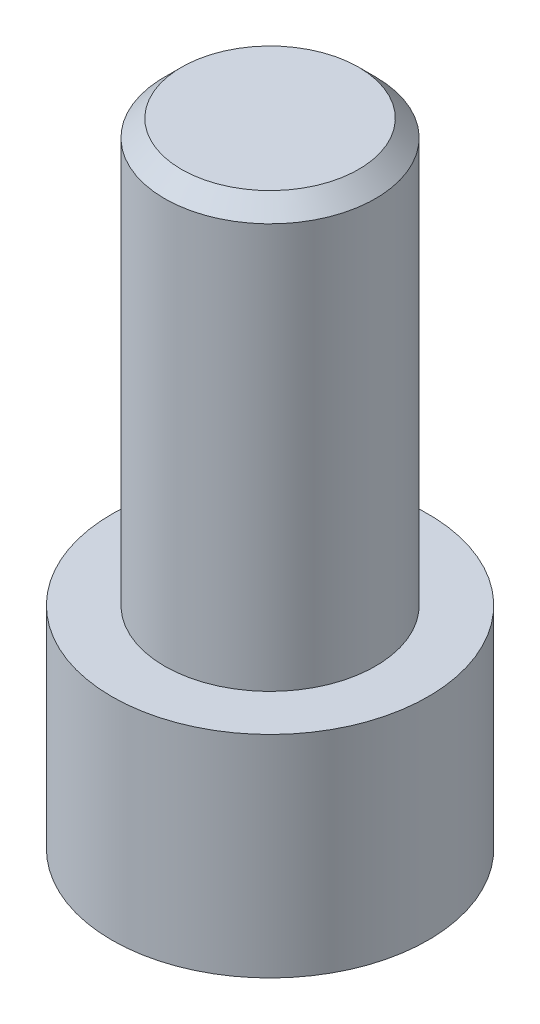
ISO-10303-21;
HEADER;
FILE_DESCRIPTION(('STEP AP214'),'2;1');
FILE_NAME('part.step','',(''),(''),'','','');
FILE_SCHEMA(('AUTOMOTIVE_DESIGN { 1 0 10303 214 1 1 1 1 }'));
ENDSEC;
DATA;
#1=APPLICATION_CONTEXT('core data for automotive mechanical design processes');
#2=APPLICATION_PROTOCOL_DEFINITION('international standard','automotive_design',2000,#1);
#3=PRODUCT_CONTEXT('',#1,'mechanical');
#4=PRODUCT('Part','Part','',(#3));
#5=PRODUCT_RELATED_PRODUCT_CATEGORY('part','',(#4));
#6=PRODUCT_DEFINITION_FORMATION('','',#4);
#7=PRODUCT_DEFINITION_CONTEXT('part definition',#1,'design');
#8=PRODUCT_DEFINITION('design','',#6,#7);
#9=PRODUCT_DEFINITION_SHAPE('','',#8);
#10=(LENGTH_UNIT() NAMED_UNIT(*) SI_UNIT(.MILLI.,.METRE.));
#11=(NAMED_UNIT(*) PLANE_ANGLE_UNIT() SI_UNIT($,.RADIAN.));
#12=(NAMED_UNIT(*) SI_UNIT($,.STERADIAN.) SOLID_ANGLE_UNIT());
#13=UNCERTAINTY_MEASURE_WITH_UNIT(LENGTH_MEASURE(1.E-05),#10,'distance_accuracy_value','');
#14=(GEOMETRIC_REPRESENTATION_CONTEXT(3) GLOBAL_UNCERTAINTY_ASSIGNED_CONTEXT((#13)) GLOBAL_UNIT_ASSIGNED_CONTEXT((#10,
#11,#12)) REPRESENTATION_CONTEXT('',''));
#15=CARTESIAN_POINT('',(0.,0.,0.));
#16=DIRECTION('',(0.,0.,1.));
#17=DIRECTION('',(1.,0.,0.));
#18=AXIS2_PLACEMENT_3D('',#15,#16,#17);
#19=CARTESIAN_POINT('',(0.,19.05,0.));
#20=DIRECTION('',(0.,-1.,0.));
#21=DIRECTION('',(0.,0.,-1.));
#22=AXIS2_PLACEMENT_3D('',#19,#20,#21);
#23=PLANE('',#22);
#24=CARTESIAN_POINT('',(0.,19.05,0.));
#25=DIRECTION('',(0.,-1.,0.));
#26=DIRECTION('',(0.,0.,-1.));
#27=AXIS2_PLACEMENT_3D('',#24,#25,#26);
#28=CIRCLE('',#27,2.667);
#29=CARTESIAN_POINT('',(0.,19.05,-2.667));
#30=VERTEX_POINT('',#29);
#31=EDGE_CURVE('E54',#30,#30,#28,.F.);
#32=ORIENTED_EDGE('',*,*,#31,.T.);
#33=EDGE_LOOP('',(#32));
#34=FACE_BOUND('',#33,.T.);
#35=ADVANCED_FACE('F44',(#34),#23,.F.);
#36=CARTESIAN_POINT('',(0.,19.05,0.));
#37=DIRECTION('',(0.,1.,0.));
#38=DIRECTION('',(0.,0.,1.));
#39=AXIS2_PLACEMENT_3D('',#36,#37,#38);
#40=CYLINDRICAL_SURFACE('',#39,3.175);
#41=CARTESIAN_POINT('',(0.,18.542,0.));
#42=DIRECTION('',(0.,-1.,0.));
#43=DIRECTION('',(0.,0.,-1.));
#44=AXIS2_PLACEMENT_3D('',#41,#42,#43);
#45=CIRCLE('',#44,3.175);
#46=CARTESIAN_POINT('',(0.,18.542,-3.175));
#47=VERTEX_POINT('',#46);
#48=EDGE_CURVE('E11',#47,#47,#45,.T.);
#49=ORIENTED_EDGE('',*,*,#48,.T.);
#50=EDGE_LOOP('',(#49));
#51=FACE_BOUND('',#50,.T.);
#52=CARTESIAN_POINT('',(0.,6.35,0.));
#53=DIRECTION('',(0.,1.,0.));
#54=DIRECTION('',(0.,0.,1.));
#55=AXIS2_PLACEMENT_3D('',#52,#53,#54);
#56=CIRCLE('',#55,3.175);
#57=CARTESIAN_POINT('',(0.,6.35,3.175));
#58=VERTEX_POINT('',#57);
#59=EDGE_CURVE('E177',#58,#58,#56,.T.);
#60=ORIENTED_EDGE('',*,*,#59,.T.);
#61=EDGE_LOOP('',(#60));
#62=FACE_BOUND('',#61,.T.);
#63=ADVANCED_FACE('F200',(#51,#62),#40,.T.);
#64=CARTESIAN_POINT('',(3.175,6.35,0.));
#65=DIRECTION('',(0.,-1.,0.));
#66=DIRECTION('',(0.,0.,-1.));
#67=AXIS2_PLACEMENT_3D('',#64,#65,#66);
#68=PLANE('',#67);
#69=ORIENTED_EDGE('',*,*,#59,.F.);
#70=EDGE_LOOP('',(#69));
#71=FACE_BOUND('',#70,.T.);
#72=CARTESIAN_POINT('',(0.,6.35,0.));
#73=DIRECTION('',(0.,1.,0.));
#74=DIRECTION('',(0.,0.,1.));
#75=AXIS2_PLACEMENT_3D('',#72,#73,#74);
#76=CIRCLE('',#75,4.7625);
#77=CARTESIAN_POINT('',(0.,6.35,4.7625));
#78=VERTEX_POINT('',#77);
#79=EDGE_CURVE('E173',#78,#78,#76,.T.);
#80=ORIENTED_EDGE('',*,*,#79,.T.);
#81=EDGE_LOOP('',(#80));
#82=FACE_BOUND('',#81,.T.);
#83=ADVANCED_FACE('F204',(#71,#82),#68,.F.);
#84=CARTESIAN_POINT('',(0.,19.05,0.));
#85=DIRECTION('',(0.,1.,0.));
#86=DIRECTION('',(0.,0.,1.));
#87=AXIS2_PLACEMENT_3D('',#84,#85,#86);
#88=CYLINDRICAL_SURFACE('',#87,4.7625);
#89=ORIENTED_EDGE('',*,*,#79,.F.);
#90=EDGE_LOOP('',(#89));
#91=FACE_BOUND('',#90,.T.);
#92=CARTESIAN_POINT('',(0.,0.,0.));
#93=DIRECTION('',(0.,1.,0.));
#94=DIRECTION('',(0.,0.,1.));
#95=AXIS2_PLACEMENT_3D('',#92,#93,#94);
#96=CIRCLE('',#95,4.7625);
#97=CARTESIAN_POINT('',(0.,0.,4.7625));
#98=VERTEX_POINT('',#97);
#99=EDGE_CURVE('E160',#98,#98,#96,.T.);
#100=ORIENTED_EDGE('',*,*,#99,.T.);
#101=EDGE_LOOP('',(#100));
#102=FACE_BOUND('',#101,.T.);
#103=ADVANCED_FACE('F195',(#91,#102),#88,.T.);
#104=CARTESIAN_POINT('',(4.7625,0.,0.));
#105=DIRECTION('',(0.,1.,0.));
#106=DIRECTION('',(0.,0.,1.));
#107=AXIS2_PLACEMENT_3D('',#104,#105,#106);
#108=PLANE('',#107);
#109=DIRECTION('',(0.297676017340403,0.,0.954666951716857));
#110=VECTOR('',#109,1.);
#111=CARTESIAN_POINT('',(1.72193667212192,0.,-1.86722631119039));
#112=LINE('',#111,#110);
#113=CARTESIAN_POINT('',(1.72193667212192,0.,-1.86722631119039));
#114=VERTEX_POINT('',#113);
#115=CARTESIAN_POINT('',(2.47803375616655,0.,0.557627746170426));
#116=VERTEX_POINT('',#115);
#117=EDGE_CURVE('E141',#114,#116,#112,.T.);
#118=ORIENTED_EDGE('',*,*,#117,.F.);
#119=DIRECTION('',(0.975603841010452,0.,0.219538482744262));
#120=VECTOR('',#119,1.);
#121=CARTESIAN_POINT('',(-0.756097084044624,0.,-2.42485405736082));
#122=LINE('',#121,#120);
#123=CARTESIAN_POINT('',(-0.756097084044624,0.,-2.42485405736082));
#124=VERTEX_POINT('',#123);
#125=EDGE_CURVE('E61',#124,#114,#122,.T.);
#126=ORIENTED_EDGE('',*,*,#125,.F.);
#127=DIRECTION('',(0.677927823670048,0.,-0.735128468972595));
#128=VECTOR('',#127,1.);
#129=CARTESIAN_POINT('',(-2.47803375616655,0.,-0.557627746170426));
#130=LINE('',#129,#128);
#131=CARTESIAN_POINT('',(-2.47803375616655,0.,-0.557627746170426));
#132=VERTEX_POINT('',#131);
#133=EDGE_CURVE('E154',#132,#124,#130,.T.);
#134=ORIENTED_EDGE('',*,*,#133,.F.);
#135=DIRECTION('',(-0.297676017340403,0.,-0.954666951716857));
#136=VECTOR('',#135,1.);
#137=CARTESIAN_POINT('',(-1.72193667212192,0.,1.86722631119039));
#138=LINE('',#137,#136);
#139=CARTESIAN_POINT('',(-1.72193667212192,0.,1.86722631119039));
#140=VERTEX_POINT('',#139);
#141=EDGE_CURVE('E151',#140,#132,#138,.T.);
#142=ORIENTED_EDGE('',*,*,#141,.F.);
#143=DIRECTION('',(-0.975603841010452,0.,-0.219538482744262));
#144=VECTOR('',#143,1.);
#145=CARTESIAN_POINT('',(0.756097084044625,0.,2.42485405736082));
#146=LINE('',#145,#144);
#147=CARTESIAN_POINT('',(0.756097084044625,0.,2.42485405736082));
#148=VERTEX_POINT('',#147);
#149=EDGE_CURVE('E109',#148,#140,#146,.T.);
#150=ORIENTED_EDGE('',*,*,#149,.F.);
#151=DIRECTION('',(-0.677927823670049,0.,0.735128468972595));
#152=VECTOR('',#151,1.);
#153=CARTESIAN_POINT('',(2.47803375616655,0.,0.557627746170426));
#154=LINE('',#153,#152);
#155=EDGE_CURVE('E145',#116,#148,#154,.T.);
#156=ORIENTED_EDGE('',*,*,#155,.F.);
#157=EDGE_LOOP('',(#118,#126,#134,#142,#150,#156));
#158=FACE_BOUND('',#157,.T.);
#159=ORIENTED_EDGE('',*,*,#99,.F.);
#160=EDGE_LOOP('',(#159));
#161=FACE_BOUND('',#160,.T.);
#162=ADVANCED_FACE('F187',(#158,#161),#108,.F.);
#163=CARTESIAN_POINT('',(0.,19.05,0.));
#164=DIRECTION('',(0.,-1.,0.));
#165=DIRECTION('',(0.,0.,-1.));
#166=AXIS2_PLACEMENT_3D('',#163,#164,#165);
#167=CONICAL_SURFACE('',#166,2.667,0.785398163397445);
#168=ORIENTED_EDGE('',*,*,#48,.F.);
#169=EDGE_LOOP('',(#168));
#170=FACE_BOUND('',#169,.T.);
#171=ORIENTED_EDGE('',*,*,#31,.F.);
#172=EDGE_LOOP('',(#171));
#173=FACE_BOUND('',#172,.T.);
#174=ADVANCED_FACE('F47',(#170,#173),#167,.T.);
#175=CARTESIAN_POINT('',(-0.756097084044624,3.81,-2.42485405736082));
#176=DIRECTION('',(0.219538482744262,0.,-0.975603841010452));
#177=DIRECTION('',(-0.975603841010452,0.,-0.219538482744262));
#178=AXIS2_PLACEMENT_3D('',#175,#176,#177);
#179=PLANE('',#178);
#180=ORIENTED_EDGE('',*,*,#125,.T.);
#181=DIRECTION('',(0.,-1.,0.));
#182=VECTOR('',#181,1.);
#183=CARTESIAN_POINT('',(1.72193667212192,3.81,-1.86722631119039));
#184=LINE('',#183,#182);
#185=CARTESIAN_POINT('',(1.72193667212192,3.81,-1.86722631119039));
#186=VERTEX_POINT('',#185);
#187=EDGE_CURVE('E91',#186,#114,#184,.T.);
#188=ORIENTED_EDGE('',*,*,#187,.F.);
#189=DIRECTION('',(0.975603841010452,0.,0.219538482744262));
#190=VECTOR('',#189,1.);
#191=CARTESIAN_POINT('',(-0.756097084044624,3.81,-2.42485405736082));
#192=LINE('',#191,#190);
#193=CARTESIAN_POINT('',(-0.756097084044624,3.81,-2.42485405736082));
#194=VERTEX_POINT('',#193);
#195=EDGE_CURVE('E157',#194,#186,#192,.T.);
#196=ORIENTED_EDGE('',*,*,#195,.F.);
#197=DIRECTION('',(0.,-1.,0.));
#198=VECTOR('',#197,1.);
#199=CARTESIAN_POINT('',(-0.756097084044624,3.81,-2.42485405736082));
#200=LINE('',#199,#198);
#201=EDGE_CURVE('E69',#194,#124,#200,.T.);
#202=ORIENTED_EDGE('',*,*,#201,.T.);
#203=EDGE_LOOP('',(#180,#188,#196,#202));
#204=FACE_BOUND('',#203,.T.);
#205=ADVANCED_FACE('F186',(#204),#179,.F.);
#206=CARTESIAN_POINT('',(-2.47803375616655,3.81,-0.557627746170426));
#207=DIRECTION('',(-0.735128468972595,0.,-0.677927823670048));
#208=DIRECTION('',(-0.677927823670048,0.,0.735128468972595));
#209=AXIS2_PLACEMENT_3D('',#206,#207,#208);
#210=PLANE('',#209);
#211=ORIENTED_EDGE('',*,*,#133,.T.);
#212=ORIENTED_EDGE('',*,*,#201,.F.);
#213=DIRECTION('',(0.677927823670048,0.,-0.735128468972595));
#214=VECTOR('',#213,1.);
#215=CARTESIAN_POINT('',(-2.47803375616655,3.81,-0.557627746170426));
#216=LINE('',#215,#214);
#217=CARTESIAN_POINT('',(-2.47803375616655,3.81,-0.557627746170426));
#218=VERTEX_POINT('',#217);
#219=EDGE_CURVE('E123',#218,#194,#216,.T.);
#220=ORIENTED_EDGE('',*,*,#219,.F.);
#221=DIRECTION('',(0.,-1.,0.));
#222=VECTOR('',#221,1.);
#223=CARTESIAN_POINT('',(-2.47803375616655,3.81,-0.557627746170426));
#224=LINE('',#223,#222);
#225=EDGE_CURVE('E114',#218,#132,#224,.T.);
#226=ORIENTED_EDGE('',*,*,#225,.T.);
#227=EDGE_LOOP('',(#211,#212,#220,#226));
#228=FACE_BOUND('',#227,.T.);
#229=ADVANCED_FACE('F193',(#228),#210,.F.);
#230=CARTESIAN_POINT('',(-1.72193667212192,3.81,1.86722631119039));
#231=DIRECTION('',(-0.954666951716857,0.,0.297676017340403));
#232=DIRECTION('',(0.297676017340403,0.,0.954666951716857));
#233=AXIS2_PLACEMENT_3D('',#230,#231,#232);
#234=PLANE('',#233);
#235=ORIENTED_EDGE('',*,*,#141,.T.);
#236=ORIENTED_EDGE('',*,*,#225,.F.);
#237=DIRECTION('',(-0.297676017340403,0.,-0.954666951716857));
#238=VECTOR('',#237,1.);
#239=CARTESIAN_POINT('',(-1.72193667212192,3.81,1.86722631119039));
#240=LINE('',#239,#238);
#241=CARTESIAN_POINT('',(-1.72193667212192,3.81,1.86722631119039));
#242=VERTEX_POINT('',#241);
#243=EDGE_CURVE('E118',#242,#218,#240,.T.);
#244=ORIENTED_EDGE('',*,*,#243,.F.);
#245=DIRECTION('',(0.,-1.,0.));
#246=VECTOR('',#245,1.);
#247=CARTESIAN_POINT('',(-1.72193667212192,3.81,1.86722631119039));
#248=LINE('',#247,#246);
#249=EDGE_CURVE('E102',#242,#140,#248,.T.);
#250=ORIENTED_EDGE('',*,*,#249,.T.);
#251=EDGE_LOOP('',(#235,#236,#244,#250));
#252=FACE_BOUND('',#251,.T.);
#253=ADVANCED_FACE('F119',(#252),#234,.F.);
#254=CARTESIAN_POINT('',(0.756097084044625,3.81,2.42485405736082));
#255=DIRECTION('',(-0.219538482744262,0.,0.975603841010452));
#256=DIRECTION('',(0.975603841010452,0.,0.219538482744262));
#257=AXIS2_PLACEMENT_3D('',#254,#255,#256);
#258=PLANE('',#257);
#259=ORIENTED_EDGE('',*,*,#149,.T.);
#260=ORIENTED_EDGE('',*,*,#249,.F.);
#261=DIRECTION('',(-0.975603841010452,0.,-0.219538482744262));
#262=VECTOR('',#261,1.);
#263=CARTESIAN_POINT('',(0.756097084044625,3.81,2.42485405736082));
#264=LINE('',#263,#262);
#265=CARTESIAN_POINT('',(0.756097084044625,3.81,2.42485405736082));
#266=VERTEX_POINT('',#265);
#267=EDGE_CURVE('E106',#266,#242,#264,.T.);
#268=ORIENTED_EDGE('',*,*,#267,.F.);
#269=DIRECTION('',(0.,-1.,0.));
#270=VECTOR('',#269,1.);
#271=CARTESIAN_POINT('',(0.756097084044625,3.81,2.42485405736082));
#272=LINE('',#271,#270);
#273=EDGE_CURVE('E115',#266,#148,#272,.T.);
#274=ORIENTED_EDGE('',*,*,#273,.T.);
#275=EDGE_LOOP('',(#259,#260,#268,#274));
#276=FACE_BOUND('',#275,.T.);
#277=ADVANCED_FACE('F104',(#276),#258,.F.);
#278=CARTESIAN_POINT('',(2.47803375616655,3.81,0.557627746170426));
#279=DIRECTION('',(0.735128468972595,0.,0.677927823670049));
#280=DIRECTION('',(0.677927823670049,0.,-0.735128468972595));
#281=AXIS2_PLACEMENT_3D('',#278,#279,#280);
#282=PLANE('',#281);
#283=ORIENTED_EDGE('',*,*,#155,.T.);
#284=ORIENTED_EDGE('',*,*,#273,.F.);
#285=DIRECTION('',(-0.677927823670049,0.,0.735128468972595));
#286=VECTOR('',#285,1.);
#287=CARTESIAN_POINT('',(2.47803375616655,3.81,0.557627746170426));
#288=LINE('',#287,#286);
#289=CARTESIAN_POINT('',(2.47803375616655,3.81,0.557627746170426));
#290=VERTEX_POINT('',#289);
#291=EDGE_CURVE('E129',#290,#266,#288,.T.);
#292=ORIENTED_EDGE('',*,*,#291,.F.);
#293=DIRECTION('',(0.,-1.,0.));
#294=VECTOR('',#293,1.);
#295=CARTESIAN_POINT('',(2.47803375616655,3.81,0.557627746170426));
#296=LINE('',#295,#294);
#297=EDGE_CURVE('E165',#290,#116,#296,.T.);
#298=ORIENTED_EDGE('',*,*,#297,.T.);
#299=EDGE_LOOP('',(#283,#284,#292,#298));
#300=FACE_BOUND('',#299,.T.);
#301=ADVANCED_FACE('F217',(#300),#282,.F.);
#302=CARTESIAN_POINT('',(1.72193667212192,3.81,-1.86722631119039));
#303=DIRECTION('',(0.954666951716857,0.,-0.297676017340403));
#304=DIRECTION('',(-0.297676017340403,0.,-0.954666951716857));
#305=AXIS2_PLACEMENT_3D('',#302,#303,#304);
#306=PLANE('',#305);
#307=ORIENTED_EDGE('',*,*,#117,.T.);
#308=ORIENTED_EDGE('',*,*,#297,.F.);
#309=DIRECTION('',(0.297676017340403,0.,0.954666951716857));
#310=VECTOR('',#309,1.);
#311=CARTESIAN_POINT('',(1.72193667212192,3.81,-1.86722631119039));
#312=LINE('',#311,#310);
#313=EDGE_CURVE('E133',#186,#290,#312,.T.);
#314=ORIENTED_EDGE('',*,*,#313,.F.);
#315=ORIENTED_EDGE('',*,*,#187,.T.);
#316=EDGE_LOOP('',(#307,#308,#314,#315));
#317=FACE_BOUND('',#316,.T.);
#318=ADVANCED_FACE('F214',(#317),#306,.F.);
#319=CARTESIAN_POINT('',(0.,3.81,0.));
#320=DIRECTION('',(0.,-1.,0.));
#321=DIRECTION('',(0.,0.,-1.));
#322=AXIS2_PLACEMENT_3D('',#319,#320,#321);
#323=PLANE('',#322);
#324=ORIENTED_EDGE('',*,*,#195,.T.);
#325=ORIENTED_EDGE('',*,*,#313,.T.);
#326=ORIENTED_EDGE('',*,*,#291,.T.);
#327=ORIENTED_EDGE('',*,*,#267,.T.);
#328=ORIENTED_EDGE('',*,*,#243,.T.);
#329=ORIENTED_EDGE('',*,*,#219,.T.);
#330=EDGE_LOOP('',(#324,#325,#326,#327,#328,#329));
#331=FACE_BOUND('',#330,.T.);
#332=ADVANCED_FACE('F126',(#331),#323,.T.);
#333=CLOSED_SHELL('',(#35,#63,#83,#103,#162,#174,#205,#229,#253,#277,#301,#318,#332));
#334=MANIFOLD_SOLID_BREP('B2',#333);
#335=ADVANCED_BREP_SHAPE_REPRESENTATION('',(#18,#334),#14);
#336=SHAPE_DEFINITION_REPRESENTATION(#9,#335);
ENDSEC;
END-ISO-10303-21;
